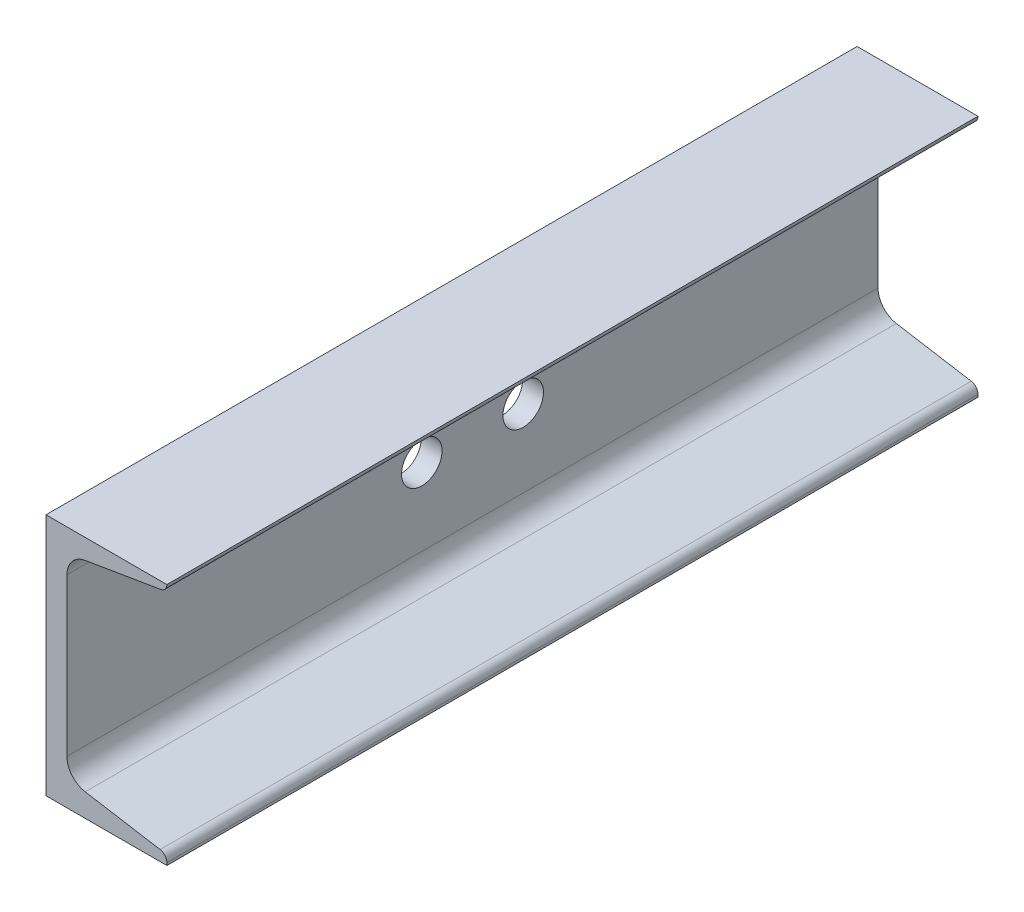
ISO-10303-21;
HEADER;
FILE_DESCRIPTION(('STEP AP214'),'2;1');
FILE_NAME('part.step','',(''),(''),'','','');
FILE_SCHEMA(('AUTOMOTIVE_DESIGN { 1 0 10303 214 1 1 1 1 }'));
ENDSEC;
DATA;
#1=APPLICATION_CONTEXT('core data for automotive mechanical design processes');
#2=APPLICATION_PROTOCOL_DEFINITION('international standard','automotive_design',2000,#1);
#3=PRODUCT_CONTEXT('',#1,'mechanical');
#4=PRODUCT('Part','Part','',(#3));
#5=PRODUCT_RELATED_PRODUCT_CATEGORY('part','',(#4));
#6=PRODUCT_DEFINITION_FORMATION('','',#4);
#7=PRODUCT_DEFINITION_CONTEXT('part definition',#1,'design');
#8=PRODUCT_DEFINITION('design','',#6,#7);
#9=PRODUCT_DEFINITION_SHAPE('','',#8);
#10=(LENGTH_UNIT() NAMED_UNIT(*) SI_UNIT(.MILLI.,.METRE.));
#11=(NAMED_UNIT(*) PLANE_ANGLE_UNIT() SI_UNIT($,.RADIAN.));
#12=(NAMED_UNIT(*) SI_UNIT($,.STERADIAN.) SOLID_ANGLE_UNIT());
#13=UNCERTAINTY_MEASURE_WITH_UNIT(LENGTH_MEASURE(1.E-05),#10,'distance_accuracy_value','');
#14=(GEOMETRIC_REPRESENTATION_CONTEXT(3) GLOBAL_UNCERTAINTY_ASSIGNED_CONTEXT((#13)) GLOBAL_UNIT_ASSIGNED_CONTEXT((#10,
#11,#12)) REPRESENTATION_CONTEXT('',''));
#15=CARTESIAN_POINT('',(0.,0.,0.));
#16=DIRECTION('',(0.,0.,1.));
#17=DIRECTION('',(1.,0.,0.));
#18=AXIS2_PLACEMENT_3D('',#15,#16,#17);
#19=CARTESIAN_POINT('',(37.846,-38.1,127.));
#20=DIRECTION('',(-1.,0.,0.));
#21=DIRECTION('',(0.,0.,1.));
#22=AXIS2_PLACEMENT_3D('',#19,#20,#21);
#23=PLANE('',#22);
#24=DIRECTION('',(0.,1.,0.));
#25=VECTOR('',#24,1.);
#26=CARTESIAN_POINT('',(37.846,-38.1,-127.));
#27=LINE('',#26,#25);
#28=CARTESIAN_POINT('',(37.846,-38.1,-127.));
#29=VERTEX_POINT('',#28);
#30=CARTESIAN_POINT('',(37.846,-37.3185419041306,-127.));
#31=VERTEX_POINT('',#30);
#32=EDGE_CURVE('E162',#29,#31,#27,.T.);
#33=ORIENTED_EDGE('',*,*,#32,.T.);
#34=DIRECTION('',(0.,0.,-1.));
#35=VECTOR('',#34,1.);
#36=CARTESIAN_POINT('',(37.846,-37.3185419041306,127.));
#37=LINE('',#36,#35);
#38=CARTESIAN_POINT('',(37.846,-37.3185419041306,127.));
#39=VERTEX_POINT('',#38);
#40=EDGE_CURVE('E11',#39,#31,#37,.T.);
#41=ORIENTED_EDGE('',*,*,#40,.F.);
#42=DIRECTION('',(0.,1.,0.));
#43=VECTOR('',#42,1.);
#44=CARTESIAN_POINT('',(37.846,-38.1,127.));
#45=LINE('',#44,#43);
#46=CARTESIAN_POINT('',(37.846,-38.1,127.));
#47=VERTEX_POINT('',#46);
#48=EDGE_CURVE('E186',#47,#39,#45,.T.);
#49=ORIENTED_EDGE('',*,*,#48,.F.);
#50=DIRECTION('',(0.,0.,-1.));
#51=VECTOR('',#50,1.);
#52=CARTESIAN_POINT('',(37.846,-38.1,127.));
#53=LINE('',#52,#51);
#54=EDGE_CURVE('E158',#47,#29,#53,.T.);
#55=ORIENTED_EDGE('',*,*,#54,.T.);
#56=EDGE_LOOP('',(#33,#41,#49,#55));
#57=FACE_BOUND('',#56,.T.);
#58=ADVANCED_FACE('F42',(#57),#23,.F.);
#59=CARTESIAN_POINT('',(35.306,-37.3185419041306,127.));
#60=DIRECTION('',(0.,0.,-1.));
#61=DIRECTION('',(-1.,0.,0.));
#62=AXIS2_PLACEMENT_3D('',#59,#60,#61);
#63=CYLINDRICAL_SURFACE('',#62,2.54);
#64=CARTESIAN_POINT('',(35.306,-37.3185419041306,-127.));
#65=DIRECTION('',(0.,0.,1.));
#66=DIRECTION('',(-1.,0.,0.));
#67=AXIS2_PLACEMENT_3D('',#64,#65,#66);
#68=CIRCLE('',#67,2.54);
#69=CARTESIAN_POINT('',(35.7252209188861,-34.813376476226,-127.));
#70=VERTEX_POINT('',#69);
#71=EDGE_CURVE('E165',#31,#70,#68,.T.);
#72=ORIENTED_EDGE('',*,*,#71,.T.);
#73=DIRECTION('',(0.,0.,-1.));
#74=VECTOR('',#73,1.);
#75=CARTESIAN_POINT('',(35.7252209188861,-34.813376476226,127.));
#76=LINE('',#75,#74);
#77=CARTESIAN_POINT('',(35.7252209188861,-34.813376476226,127.));
#78=VERTEX_POINT('',#77);
#79=EDGE_CURVE('E50',#78,#70,#76,.T.);
#80=ORIENTED_EDGE('',*,*,#79,.F.);
#81=CARTESIAN_POINT('',(35.306,-37.3185419041306,127.));
#82=DIRECTION('',(0.,0.,1.));
#83=DIRECTION('',(-1.,0.,0.));
#84=AXIS2_PLACEMENT_3D('',#81,#82,#83);
#85=CIRCLE('',#84,2.54);
#86=EDGE_CURVE('E113',#39,#78,#85,.T.);
#87=ORIENTED_EDGE('',*,*,#86,.F.);
#88=ORIENTED_EDGE('',*,*,#40,.T.);
#89=EDGE_LOOP('',(#72,#80,#87,#88));
#90=FACE_BOUND('',#89,.T.);
#91=ADVANCED_FACE('F264',(#90),#63,.T.);
#92=CARTESIAN_POINT('',(12.2793035190076,-30.889875486223,127.));
#93=DIRECTION('',(-0.165047605860671,-0.986285601537232,0.));
#94=DIRECTION('',(0.986285601537233,-0.165047605860671,0.));
#95=AXIS2_PLACEMENT_3D('',#92,#93,#94);
#96=PLANE('',#95);
#97=DIRECTION('',(-0.986285601537232,0.165047605860671,0.));
#98=VECTOR('',#97,1.);
#99=CARTESIAN_POINT('',(12.2793035190076,-30.889875486223,-127.));
#100=LINE('',#99,#98);
#101=CARTESIAN_POINT('',(12.2793035190076,-30.889875486223,-127.));
#102=VERTEX_POINT('',#101);
#103=EDGE_CURVE('E168',#70,#102,#100,.T.);
#104=ORIENTED_EDGE('',*,*,#103,.T.);
#105=DIRECTION('',(0.,0.,-1.));
#106=VECTOR('',#105,1.);
#107=CARTESIAN_POINT('',(12.2793035190076,-30.889875486223,127.));
#108=LINE('',#107,#106);
#109=CARTESIAN_POINT('',(12.2793035190076,-30.889875486223,127.));
#110=VERTEX_POINT('',#109);
#111=EDGE_CURVE('E205',#110,#102,#108,.T.);
#112=ORIENTED_EDGE('',*,*,#111,.F.);
#113=DIRECTION('',(-0.986285601537232,0.165047605860671,0.));
#114=VECTOR('',#113,1.);
#115=CARTESIAN_POINT('',(12.2793035190076,-30.889875486223,127.));
#116=LINE('',#115,#114);
#117=EDGE_CURVE('E213',#78,#110,#116,.T.);
#118=ORIENTED_EDGE('',*,*,#117,.F.);
#119=ORIENTED_EDGE('',*,*,#79,.T.);
#120=EDGE_LOOP('',(#104,#112,#118,#119));
#121=FACE_BOUND('',#120,.T.);
#122=ADVANCED_FACE('F211',(#121),#96,.F.);
#123=CARTESIAN_POINT('',(13.4112,-24.1259288308807,127.));
#124=DIRECTION('',(0.,0.,-1.));
#125=DIRECTION('',(-1.,0.,0.));
#126=AXIS2_PLACEMENT_3D('',#123,#124,#125);
#127=CYLINDRICAL_SURFACE('',#126,6.858);
#128=CARTESIAN_POINT('',(13.4112,-24.1259288308807,-127.));
#129=DIRECTION('',(0.,0.,-1.));
#130=DIRECTION('',(1.,0.,0.));
#131=AXIS2_PLACEMENT_3D('',#128,#129,#130);
#132=CIRCLE('',#131,6.858);
#133=CARTESIAN_POINT('',(6.55320000000001,-24.1259288308806,-127.));
#134=VERTEX_POINT('',#133);
#135=EDGE_CURVE('E170',#102,#134,#132,.T.);
#136=ORIENTED_EDGE('',*,*,#135,.T.);
#137=DIRECTION('',(0.,0.,-1.));
#138=VECTOR('',#137,1.);
#139=CARTESIAN_POINT('',(6.55320000000001,-24.1259288308806,127.));
#140=LINE('',#139,#138);
#141=CARTESIAN_POINT('',(6.55320000000001,-24.1259288308806,127.));
#142=VERTEX_POINT('',#141);
#143=EDGE_CURVE('E202',#142,#134,#140,.T.);
#144=ORIENTED_EDGE('',*,*,#143,.F.);
#145=CARTESIAN_POINT('',(13.4112,-24.1259288308807,127.));
#146=DIRECTION('',(0.,0.,-1.));
#147=DIRECTION('',(1.,0.,0.));
#148=AXIS2_PLACEMENT_3D('',#145,#146,#147);
#149=CIRCLE('',#148,6.858);
#150=EDGE_CURVE('E231',#110,#142,#149,.T.);
#151=ORIENTED_EDGE('',*,*,#150,.F.);
#152=ORIENTED_EDGE('',*,*,#111,.T.);
#153=EDGE_LOOP('',(#136,#144,#151,#152));
#154=FACE_BOUND('',#153,.T.);
#155=ADVANCED_FACE('F222',(#154),#127,.F.);
#156=CARTESIAN_POINT('',(6.5532,25.1016128592281,127.));
#157=DIRECTION('',(-1.,0.,0.));
#158=DIRECTION('',(0.,-1.,0.));
#159=AXIS2_PLACEMENT_3D('',#156,#157,#158);
#160=PLANE('',#159);
#161=CARTESIAN_POINT('',(6.5532,0.,15.875));
#162=DIRECTION('',(-1.,0.,0.));
#163=DIRECTION('',(0.,-1.,0.));
#164=AXIS2_PLACEMENT_3D('',#161,#162,#163);
#165=CIRCLE('',#164,6.35);
#166=CARTESIAN_POINT('',(6.5532,-6.35,15.875));
#167=VERTEX_POINT('',#166);
#168=EDGE_CURVE('E415',#167,#167,#165,.F.);
#169=ORIENTED_EDGE('',*,*,#168,.F.);
#170=EDGE_LOOP('',(#169));
#171=FACE_BOUND('',#170,.T.);
#172=CARTESIAN_POINT('',(6.5532,0.,-15.875));
#173=DIRECTION('',(-1.,0.,0.));
#174=DIRECTION('',(0.,-1.,0.));
#175=AXIS2_PLACEMENT_3D('',#172,#173,#174);
#176=CIRCLE('',#175,6.35);
#177=CARTESIAN_POINT('',(6.5532,-6.35,-15.875));
#178=VERTEX_POINT('',#177);
#179=EDGE_CURVE('E166',#178,#178,#176,.F.);
#180=ORIENTED_EDGE('',*,*,#179,.F.);
#181=EDGE_LOOP('',(#180));
#182=FACE_BOUND('',#181,.T.);
#183=DIRECTION('',(0.,1.,0.));
#184=VECTOR('',#183,1.);
#185=CARTESIAN_POINT('',(6.5532,25.1016128592281,-127.));
#186=LINE('',#185,#184);
#187=CARTESIAN_POINT('',(6.5532,25.1016128592281,-127.));
#188=VERTEX_POINT('',#187);
#189=EDGE_CURVE('E172',#134,#188,#186,.T.);
#190=ORIENTED_EDGE('',*,*,#189,.T.);
#191=DIRECTION('',(0.,0.,-1.));
#192=VECTOR('',#191,1.);
#193=CARTESIAN_POINT('',(6.5532,25.1016128592281,127.));
#194=LINE('',#193,#192);
#195=CARTESIAN_POINT('',(6.5532,25.1016128592281,127.));
#196=VERTEX_POINT('',#195);
#197=EDGE_CURVE('E199',#196,#188,#194,.T.);
#198=ORIENTED_EDGE('',*,*,#197,.F.);
#199=DIRECTION('',(0.,1.,0.));
#200=VECTOR('',#199,1.);
#201=CARTESIAN_POINT('',(6.5532,25.1016128592281,127.));
#202=LINE('',#201,#200);
#203=EDGE_CURVE('E228',#142,#196,#202,.T.);
#204=ORIENTED_EDGE('',*,*,#203,.F.);
#205=ORIENTED_EDGE('',*,*,#143,.T.);
#206=EDGE_LOOP('',(#190,#198,#204,#205));
#207=FACE_BOUND('',#206,.T.);
#208=ADVANCED_FACE('F226',(#171,#182,#207),#160,.F.);
#209=CARTESIAN_POINT('',(13.4112,25.1016128592282,127.));
#210=DIRECTION('',(0.,0.,-1.));
#211=DIRECTION('',(-1.,0.,0.));
#212=AXIS2_PLACEMENT_3D('',#209,#210,#211);
#213=CYLINDRICAL_SURFACE('',#212,6.858);
#214=CARTESIAN_POINT('',(13.4112,25.1016128592282,-127.));
#215=DIRECTION('',(0.,0.,-1.));
#216=DIRECTION('',(1.,0.,0.));
#217=AXIS2_PLACEMENT_3D('',#214,#215,#216);
#218=CIRCLE('',#217,6.858);
#219=CARTESIAN_POINT('',(12.2793035190075,31.8655595145705,-127.));
#220=VERTEX_POINT('',#219);
#221=EDGE_CURVE('E174',#188,#220,#218,.T.);
#222=ORIENTED_EDGE('',*,*,#221,.T.);
#223=DIRECTION('',(0.,0.,-1.));
#224=VECTOR('',#223,1.);
#225=CARTESIAN_POINT('',(12.2793035190075,31.8655595145705,127.));
#226=LINE('',#225,#224);
#227=CARTESIAN_POINT('',(12.2793035190075,31.8655595145705,127.));
#228=VERTEX_POINT('',#227);
#229=EDGE_CURVE('E196',#228,#220,#226,.T.);
#230=ORIENTED_EDGE('',*,*,#229,.F.);
#231=CARTESIAN_POINT('',(13.4112,25.1016128592282,127.));
#232=DIRECTION('',(0.,0.,-1.));
#233=DIRECTION('',(1.,0.,0.));
#234=AXIS2_PLACEMENT_3D('',#231,#232,#233);
#235=CIRCLE('',#234,6.858);
#236=EDGE_CURVE('E230',#196,#228,#235,.T.);
#237=ORIENTED_EDGE('',*,*,#236,.F.);
#238=ORIENTED_EDGE('',*,*,#197,.T.);
#239=EDGE_LOOP('',(#222,#230,#237,#238));
#240=FACE_BOUND('',#239,.T.);
#241=ADVANCED_FACE('F277',(#240),#213,.F.);
#242=CARTESIAN_POINT('',(12.2793035190075,31.8655595145705,127.));
#243=DIRECTION('',(-0.165047605860678,0.986285601537231,0.));
#244=DIRECTION('',(-0.986285601537231,-0.165047605860678,0.));
#245=AXIS2_PLACEMENT_3D('',#242,#243,#244);
#246=PLANE('',#245);
#247=DIRECTION('',(0.986285601537231,0.165047605860678,0.));
#248=VECTOR('',#247,1.);
#249=CARTESIAN_POINT('',(12.2793035190075,31.8655595145705,-127.));
#250=LINE('',#249,#248);
#251=CARTESIAN_POINT('',(35.9372988269975,35.8245501750456,-127.));
#252=VERTEX_POINT('',#251);
#253=EDGE_CURVE('E176',#220,#252,#250,.T.);
#254=ORIENTED_EDGE('',*,*,#253,.T.);
#255=DIRECTION('',(0.,0.,-1.));
#256=VECTOR('',#255,1.);
#257=CARTESIAN_POINT('',(35.9372988269975,35.8245501750456,127.));
#258=LINE('',#257,#256);
#259=CARTESIAN_POINT('',(35.9372988269975,35.8245501750456,127.));
#260=VERTEX_POINT('',#259);
#261=EDGE_CURVE('E193',#260,#252,#258,.T.);
#262=ORIENTED_EDGE('',*,*,#261,.F.);
#263=DIRECTION('',(0.986285601537231,0.165047605860678,0.));
#264=VECTOR('',#263,1.);
#265=CARTESIAN_POINT('',(12.2793035190075,31.8655595145705,127.));
#266=LINE('',#265,#264);
#267=EDGE_CURVE('E233',#228,#260,#266,.T.);
#268=ORIENTED_EDGE('',*,*,#267,.F.);
#269=ORIENTED_EDGE('',*,*,#229,.T.);
#270=EDGE_LOOP('',(#254,#262,#268,#269));
#271=FACE_BOUND('',#270,.T.);
#272=ADVANCED_FACE('F281',(#271),#246,.F.);
#273=CARTESIAN_POINT('',(35.56,38.0791990601597,127.));
#274=DIRECTION('',(0.,0.,-1.));
#275=DIRECTION('',(-1.,0.,0.));
#276=AXIS2_PLACEMENT_3D('',#273,#274,#275);
#277=CYLINDRICAL_SURFACE('',#276,2.286);
#278=CARTESIAN_POINT('',(35.56,38.0791990601597,-127.));
#279=DIRECTION('',(0.,0.,1.));
#280=DIRECTION('',(1.,0.,0.));
#281=AXIS2_PLACEMENT_3D('',#278,#279,#280);
#282=CIRCLE('',#281,2.286);
#283=CARTESIAN_POINT('',(37.846,38.0791990601597,-127.));
#284=VERTEX_POINT('',#283);
#285=EDGE_CURVE('E178',#252,#284,#282,.T.);
#286=ORIENTED_EDGE('',*,*,#285,.T.);
#287=DIRECTION('',(0.,0.,-1.));
#288=VECTOR('',#287,1.);
#289=CARTESIAN_POINT('',(37.846,38.0791990601597,127.));
#290=LINE('',#289,#288);
#291=CARTESIAN_POINT('',(37.846,38.0791990601597,127.));
#292=VERTEX_POINT('',#291);
#293=EDGE_CURVE('E190',#292,#284,#290,.T.);
#294=ORIENTED_EDGE('',*,*,#293,.F.);
#295=CARTESIAN_POINT('',(35.56,38.0791990601597,127.));
#296=DIRECTION('',(0.,0.,1.));
#297=DIRECTION('',(1.,0.,0.));
#298=AXIS2_PLACEMENT_3D('',#295,#296,#297);
#299=CIRCLE('',#298,2.286);
#300=EDGE_CURVE('E239',#260,#292,#299,.T.);
#301=ORIENTED_EDGE('',*,*,#300,.F.);
#302=ORIENTED_EDGE('',*,*,#261,.T.);
#303=EDGE_LOOP('',(#286,#294,#301,#302));
#304=FACE_BOUND('',#303,.T.);
#305=ADVANCED_FACE('F245',(#304),#277,.T.);
#306=CARTESIAN_POINT('',(37.846,38.1,127.));
#307=DIRECTION('',(-1.,0.,0.));
#308=DIRECTION('',(0.,0.,1.));
#309=AXIS2_PLACEMENT_3D('',#306,#307,#308);
#310=PLANE('',#309);
#311=DIRECTION('',(0.,1.,0.));
#312=VECTOR('',#311,1.);
#313=CARTESIAN_POINT('',(37.846,38.1,-127.));
#314=LINE('',#313,#312);
#315=CARTESIAN_POINT('',(37.846,38.1,-127.));
#316=VERTEX_POINT('',#315);
#317=EDGE_CURVE('E181',#284,#316,#314,.T.);
#318=ORIENTED_EDGE('',*,*,#317,.T.);
#319=DIRECTION('',(0.,0.,-1.));
#320=VECTOR('',#319,1.);
#321=CARTESIAN_POINT('',(37.846,38.1,127.));
#322=LINE('',#321,#320);
#323=CARTESIAN_POINT('',(37.846,38.1,127.));
#324=VERTEX_POINT('',#323);
#325=EDGE_CURVE('E153',#324,#316,#322,.T.);
#326=ORIENTED_EDGE('',*,*,#325,.F.);
#327=DIRECTION('',(0.,1.,0.));
#328=VECTOR('',#327,1.);
#329=CARTESIAN_POINT('',(37.846,38.0953738516822,127.));
#330=LINE('',#329,#328);
#331=EDGE_CURVE('E144',#292,#324,#330,.T.);
#332=ORIENTED_EDGE('',*,*,#331,.F.);
#333=ORIENTED_EDGE('',*,*,#293,.T.);
#334=EDGE_LOOP('',(#318,#326,#332,#333));
#335=FACE_BOUND('',#334,.T.);
#336=ADVANCED_FACE('F248',(#335),#310,.F.);
#337=CARTESIAN_POINT('',(0.,38.1,127.));
#338=DIRECTION('',(0.,-1.,0.));
#339=DIRECTION('',(0.,0.,-1.));
#340=AXIS2_PLACEMENT_3D('',#337,#338,#339);
#341=PLANE('',#340);
#342=DIRECTION('',(-1.,0.,0.));
#343=VECTOR('',#342,1.);
#344=CARTESIAN_POINT('',(0.,38.1,-127.));
#345=LINE('',#344,#343);
#346=CARTESIAN_POINT('',(0.,38.1,-127.));
#347=VERTEX_POINT('',#346);
#348=EDGE_CURVE('E152',#316,#347,#345,.T.);
#349=ORIENTED_EDGE('',*,*,#348,.T.);
#350=DIRECTION('',(0.,0.,-1.));
#351=VECTOR('',#350,1.);
#352=CARTESIAN_POINT('',(0.,38.1,127.));
#353=LINE('',#352,#351);
#354=CARTESIAN_POINT('',(0.,38.1,127.));
#355=VERTEX_POINT('',#354);
#356=EDGE_CURVE('E149',#355,#347,#353,.T.);
#357=ORIENTED_EDGE('',*,*,#356,.F.);
#358=DIRECTION('',(-1.,0.,0.));
#359=VECTOR('',#358,1.);
#360=CARTESIAN_POINT('',(0.,38.1,127.));
#361=LINE('',#360,#359);
#362=EDGE_CURVE('E138',#324,#355,#361,.T.);
#363=ORIENTED_EDGE('',*,*,#362,.F.);
#364=ORIENTED_EDGE('',*,*,#325,.T.);
#365=EDGE_LOOP('',(#349,#357,#363,#364));
#366=FACE_BOUND('',#365,.T.);
#367=ADVANCED_FACE('F150',(#366),#341,.F.);
#368=CARTESIAN_POINT('',(0.,-38.1,127.));
#369=DIRECTION('',(1.,0.,0.));
#370=DIRECTION('',(0.,0.,-1.));
#371=AXIS2_PLACEMENT_3D('',#368,#369,#370);
#372=PLANE('',#371);
#373=CARTESIAN_POINT('',(0.,0.,15.875));
#374=DIRECTION('',(-1.,0.,0.));
#375=DIRECTION('',(0.,0.,1.));
#376=AXIS2_PLACEMENT_3D('',#373,#374,#375);
#377=CIRCLE('',#376,6.35);
#378=CARTESIAN_POINT('',(0.,0.,22.225));
#379=VERTEX_POINT('',#378);
#380=EDGE_CURVE('E412',#379,#379,#377,.T.);
#381=ORIENTED_EDGE('',*,*,#380,.F.);
#382=EDGE_LOOP('',(#381));
#383=FACE_BOUND('',#382,.T.);
#384=CARTESIAN_POINT('',(0.,0.,-15.875));
#385=DIRECTION('',(-1.,0.,0.));
#386=DIRECTION('',(0.,0.,1.));
#387=AXIS2_PLACEMENT_3D('',#384,#385,#386);
#388=CIRCLE('',#387,6.35);
#389=CARTESIAN_POINT('',(0.,0.,-9.525));
#390=VERTEX_POINT('',#389);
#391=EDGE_CURVE('E416',#390,#390,#388,.T.);
#392=ORIENTED_EDGE('',*,*,#391,.F.);
#393=EDGE_LOOP('',(#392));
#394=FACE_BOUND('',#393,.T.);
#395=DIRECTION('',(0.,-1.,0.));
#396=VECTOR('',#395,1.);
#397=CARTESIAN_POINT('',(0.,-38.1,-127.));
#398=LINE('',#397,#396);
#399=CARTESIAN_POINT('',(0.,-38.1,-127.));
#400=VERTEX_POINT('',#399);
#401=EDGE_CURVE('E99',#347,#400,#398,.T.);
#402=ORIENTED_EDGE('',*,*,#401,.T.);
#403=DIRECTION('',(0.,0.,-1.));
#404=VECTOR('',#403,1.);
#405=CARTESIAN_POINT('',(0.,-38.1,127.));
#406=LINE('',#405,#404);
#407=CARTESIAN_POINT('',(0.,-38.1,127.));
#408=VERTEX_POINT('',#407);
#409=EDGE_CURVE('E154',#408,#400,#406,.T.);
#410=ORIENTED_EDGE('',*,*,#409,.F.);
#411=DIRECTION('',(0.,-1.,0.));
#412=VECTOR('',#411,1.);
#413=CARTESIAN_POINT('',(0.,-38.1,127.));
#414=LINE('',#413,#412);
#415=EDGE_CURVE('E142',#355,#408,#414,.T.);
#416=ORIENTED_EDGE('',*,*,#415,.F.);
#417=ORIENTED_EDGE('',*,*,#356,.T.);
#418=EDGE_LOOP('',(#402,#410,#416,#417));
#419=FACE_BOUND('',#418,.T.);
#420=ADVANCED_FACE('F156',(#383,#394,#419),#372,.F.);
#421=CARTESIAN_POINT('',(37.846,-38.1,127.));
#422=DIRECTION('',(0.,1.,0.));
#423=DIRECTION('',(-1.,0.,0.));
#424=AXIS2_PLACEMENT_3D('',#421,#422,#423);
#425=PLANE('',#424);
#426=DIRECTION('',(1.,0.,0.));
#427=VECTOR('',#426,1.);
#428=CARTESIAN_POINT('',(37.846,-38.1,-127.));
#429=LINE('',#428,#427);
#430=EDGE_CURVE('E105',#400,#29,#429,.T.);
#431=ORIENTED_EDGE('',*,*,#430,.T.);
#432=ORIENTED_EDGE('',*,*,#54,.F.);
#433=DIRECTION('',(1.,0.,0.));
#434=VECTOR('',#433,1.);
#435=CARTESIAN_POINT('',(37.846,-38.1,127.));
#436=LINE('',#435,#434);
#437=EDGE_CURVE('E58',#408,#47,#436,.T.);
#438=ORIENTED_EDGE('',*,*,#437,.F.);
#439=ORIENTED_EDGE('',*,*,#409,.T.);
#440=EDGE_LOOP('',(#431,#432,#438,#439));
#441=FACE_BOUND('',#440,.T.);
#442=ADVANCED_FACE('F252',(#441),#425,.F.);
#443=CARTESIAN_POINT('',(35.306,-37.3185419041306,127.));
#444=DIRECTION('',(0.,0.,-1.));
#445=DIRECTION('',(-1.,0.,0.));
#446=AXIS2_PLACEMENT_3D('',#443,#444,#445);
#447=PLANE('',#446);
#448=ORIENTED_EDGE('',*,*,#48,.T.);
#449=ORIENTED_EDGE('',*,*,#86,.T.);
#450=ORIENTED_EDGE('',*,*,#117,.T.);
#451=ORIENTED_EDGE('',*,*,#150,.T.);
#452=ORIENTED_EDGE('',*,*,#203,.T.);
#453=ORIENTED_EDGE('',*,*,#236,.T.);
#454=ORIENTED_EDGE('',*,*,#267,.T.);
#455=ORIENTED_EDGE('',*,*,#300,.T.);
#456=ORIENTED_EDGE('',*,*,#331,.T.);
#457=ORIENTED_EDGE('',*,*,#362,.T.);
#458=ORIENTED_EDGE('',*,*,#415,.T.);
#459=ORIENTED_EDGE('',*,*,#437,.T.);
#460=EDGE_LOOP('',(#448,#449,#450,#451,#452,#453,#454,#455,#456,#457,#458,#459));
#461=FACE_BOUND('',#460,.T.);
#462=ADVANCED_FACE('F140',(#461),#447,.F.);
#463=CARTESIAN_POINT('',(35.306,-37.3185419041306,-127.));
#464=DIRECTION('',(0.,0.,-1.));
#465=DIRECTION('',(-1.,0.,0.));
#466=AXIS2_PLACEMENT_3D('',#463,#464,#465);
#467=PLANE('',#466);
#468=ORIENTED_EDGE('',*,*,#32,.F.);
#469=ORIENTED_EDGE('',*,*,#430,.F.);
#470=ORIENTED_EDGE('',*,*,#401,.F.);
#471=ORIENTED_EDGE('',*,*,#348,.F.);
#472=ORIENTED_EDGE('',*,*,#317,.F.);
#473=ORIENTED_EDGE('',*,*,#285,.F.);
#474=ORIENTED_EDGE('',*,*,#253,.F.);
#475=ORIENTED_EDGE('',*,*,#221,.F.);
#476=ORIENTED_EDGE('',*,*,#189,.F.);
#477=ORIENTED_EDGE('',*,*,#135,.F.);
#478=ORIENTED_EDGE('',*,*,#103,.F.);
#479=ORIENTED_EDGE('',*,*,#71,.F.);
#480=EDGE_LOOP('',(#468,#469,#470,#471,#472,#473,#474,#475,#476,#477,#478,#479));
#481=FACE_BOUND('',#480,.T.);
#482=ADVANCED_FACE('F217',(#481),#467,.T.);
#483=CARTESIAN_POINT('',(37.847,0.,-15.875));
#484=DIRECTION('',(-1.,0.,0.));
#485=DIRECTION('',(0.,0.,1.));
#486=AXIS2_PLACEMENT_3D('',#483,#484,#485);
#487=CYLINDRICAL_SURFACE('',#486,6.35);
#488=ORIENTED_EDGE('',*,*,#391,.T.);
#489=EDGE_LOOP('',(#488));
#490=FACE_BOUND('',#489,.T.);
#491=ORIENTED_EDGE('',*,*,#179,.T.);
#492=EDGE_LOOP('',(#491));
#493=FACE_BOUND('',#492,.T.);
#494=ADVANCED_FACE('F308',(#490,#493),#487,.F.);
#495=CARTESIAN_POINT('',(37.847,0.,15.875));
#496=DIRECTION('',(-1.,0.,0.));
#497=DIRECTION('',(0.,0.,1.));
#498=AXIS2_PLACEMENT_3D('',#495,#496,#497);
#499=CYLINDRICAL_SURFACE('',#498,6.35);
#500=ORIENTED_EDGE('',*,*,#380,.T.);
#501=EDGE_LOOP('',(#500));
#502=FACE_BOUND('',#501,.T.);
#503=ORIENTED_EDGE('',*,*,#168,.T.);
#504=EDGE_LOOP('',(#503));
#505=FACE_BOUND('',#504,.T.);
#506=ADVANCED_FACE('F311',(#502,#505),#499,.F.);
#507=CLOSED_SHELL('',(#58,#91,#122,#155,#208,#241,#272,#305,#336,#367,#420,#442,#462,#482,#494,#506));
#508=MANIFOLD_SOLID_BREP('B2',#507);
#509=ADVANCED_BREP_SHAPE_REPRESENTATION('',(#18,#508),#14);
#510=SHAPE_DEFINITION_REPRESENTATION(#9,#509);
ENDSEC;
END-ISO-10303-21;
